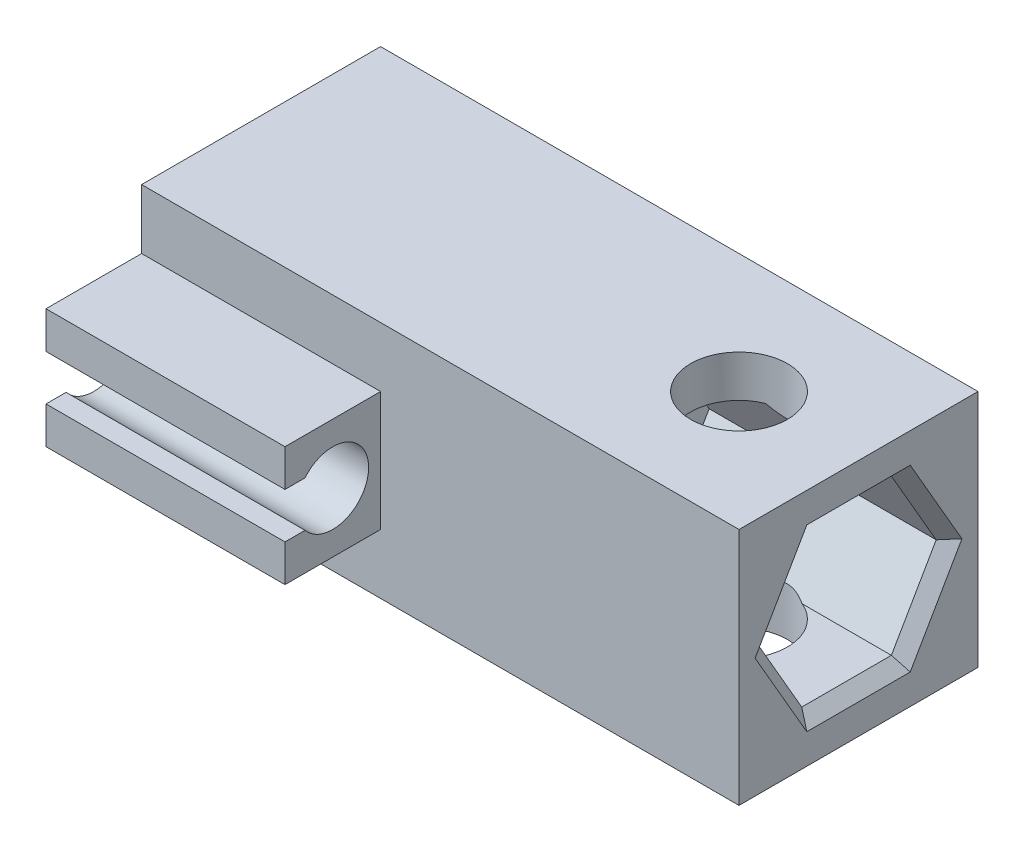
ISO-10303-21;
HEADER;
FILE_DESCRIPTION(('STEP AP214'),'2;1');
FILE_NAME('part.step','',(''),(''),'','','');
FILE_SCHEMA(('AUTOMOTIVE_DESIGN { 1 0 10303 214 1 1 1 1 }'));
ENDSEC;
DATA;
#1=APPLICATION_CONTEXT('core data for automotive mechanical design processes');
#2=APPLICATION_PROTOCOL_DEFINITION('international standard','automotive_design',2000,#1);
#3=PRODUCT_CONTEXT('',#1,'mechanical');
#4=PRODUCT('Part','Part','',(#3));
#5=PRODUCT_RELATED_PRODUCT_CATEGORY('part','',(#4));
#6=PRODUCT_DEFINITION_FORMATION('','',#4);
#7=PRODUCT_DEFINITION_CONTEXT('part definition',#1,'design');
#8=PRODUCT_DEFINITION('design','',#6,#7);
#9=PRODUCT_DEFINITION_SHAPE('','',#8);
#10=(LENGTH_UNIT() NAMED_UNIT(*) SI_UNIT(.MILLI.,.METRE.));
#11=(NAMED_UNIT(*) PLANE_ANGLE_UNIT() SI_UNIT($,.RADIAN.));
#12=(NAMED_UNIT(*) SI_UNIT($,.STERADIAN.) SOLID_ANGLE_UNIT());
#13=UNCERTAINTY_MEASURE_WITH_UNIT(LENGTH_MEASURE(1.E-05),#10,'distance_accuracy_value','');
#14=(GEOMETRIC_REPRESENTATION_CONTEXT(3) GLOBAL_UNCERTAINTY_ASSIGNED_CONTEXT((#13)) GLOBAL_UNIT_ASSIGNED_CONTEXT((#10,
#11,#12)) REPRESENTATION_CONTEXT('',''));
#15=CARTESIAN_POINT('',(0.,0.,0.));
#16=DIRECTION('',(0.,0.,1.));
#17=DIRECTION('',(1.,0.,0.));
#18=AXIS2_PLACEMENT_3D('',#15,#16,#17);
#19=CARTESIAN_POINT('',(25.,20.,10.));
#20=DIRECTION('',(0.,0.,-1.));
#21=DIRECTION('',(-1.,0.,0.));
#22=AXIS2_PLACEMENT_3D('',#19,#20,#21);
#23=PLANE('',#22);
#24=DIRECTION('',(-1.,0.,0.));
#25=VECTOR('',#24,1.);
#26=CARTESIAN_POINT('',(-5.00000000000004,15.,10.));
#27=LINE('',#26,#25);
#28=CARTESIAN_POINT('',(-5.00000000000004,15.,10.));
#29=VERTEX_POINT('',#28);
#30=CARTESIAN_POINT('',(-25.,15.,10.));
#31=VERTEX_POINT('',#30);
#32=EDGE_CURVE('E227',#29,#31,#27,.T.);
#33=ORIENTED_EDGE('',*,*,#32,.F.);
#34=DIRECTION('',(0.,-1.,0.));
#35=VECTOR('',#34,1.);
#36=CARTESIAN_POINT('',(-5.00000000000004,5.,10.));
#37=LINE('',#36,#35);
#38=CARTESIAN_POINT('',(-5.00000000000004,5.,10.));
#39=VERTEX_POINT('',#38);
#40=EDGE_CURVE('E219',#29,#39,#37,.T.);
#41=ORIENTED_EDGE('',*,*,#40,.T.);
#42=DIRECTION('',(-1.,0.,0.));
#43=VECTOR('',#42,1.);
#44=CARTESIAN_POINT('',(-5.00000000000004,5.,10.));
#45=LINE('',#44,#43);
#46=CARTESIAN_POINT('',(-25.,5.,10.));
#47=VERTEX_POINT('',#46);
#48=EDGE_CURVE('E203',#39,#47,#45,.T.);
#49=ORIENTED_EDGE('',*,*,#48,.T.);
#50=DIRECTION('',(0.,-1.,0.));
#51=VECTOR('',#50,1.);
#52=CARTESIAN_POINT('',(-25.,20.,10.));
#53=LINE('',#52,#51);
#54=CARTESIAN_POINT('',(-25.,0.,10.));
#55=VERTEX_POINT('',#54);
#56=EDGE_CURVE('E358',#47,#55,#53,.T.);
#57=ORIENTED_EDGE('',*,*,#56,.T.);
#58=DIRECTION('',(1.,0.,0.));
#59=VECTOR('',#58,1.);
#60=CARTESIAN_POINT('',(25.,0.,10.));
#61=LINE('',#60,#59);
#62=CARTESIAN_POINT('',(25.,0.,10.));
#63=VERTEX_POINT('',#62);
#64=EDGE_CURVE('E345',#55,#63,#61,.T.);
#65=ORIENTED_EDGE('',*,*,#64,.T.);
#66=DIRECTION('',(0.,-1.,0.));
#67=VECTOR('',#66,1.);
#68=CARTESIAN_POINT('',(25.,20.,10.));
#69=LINE('',#68,#67);
#70=CARTESIAN_POINT('',(25.,20.,10.));
#71=VERTEX_POINT('',#70);
#72=EDGE_CURVE('E355',#71,#63,#69,.T.);
#73=ORIENTED_EDGE('',*,*,#72,.F.);
#74=DIRECTION('',(1.,0.,0.));
#75=VECTOR('',#74,1.);
#76=CARTESIAN_POINT('',(25.,20.,10.));
#77=LINE('',#76,#75);
#78=CARTESIAN_POINT('',(-25.,20.,10.));
#79=VERTEX_POINT('',#78);
#80=EDGE_CURVE('E335',#79,#71,#77,.T.);
#81=ORIENTED_EDGE('',*,*,#80,.F.);
#82=EDGE_CURVE('E359',#79,#31,#53,.T.);
#83=ORIENTED_EDGE('',*,*,#82,.T.);
#84=EDGE_LOOP('',(#33,#41,#49,#57,#65,#73,#81,#83));
#85=FACE_BOUND('',#84,.T.);
#86=ADVANCED_FACE('F35',(#85),#23,.F.);
#87=CARTESIAN_POINT('',(25.,10.,0.));
#88=DIRECTION('',(-1.,0.,0.));
#89=DIRECTION('',(0.,0.,1.));
#90=AXIS2_PLACEMENT_3D('',#87,#88,#89);
#91=CYLINDRICAL_SURFACE('',#90,4.1);
#92=CARTESIAN_POINT('',(-25.,10.,0.));
#93=DIRECTION('',(-1.,0.,0.));
#94=DIRECTION('',(0.,0.,1.));
#95=AXIS2_PLACEMENT_3D('',#92,#93,#94);
#96=CIRCLE('',#95,4.1);
#97=CARTESIAN_POINT('',(-25.,10.,4.10000000000001));
#98=VERTEX_POINT('',#97);
#99=EDGE_CURVE('E322',#98,#98,#96,.T.);
#100=ORIENTED_EDGE('',*,*,#99,.T.);
#101=EDGE_LOOP('',(#100));
#102=FACE_BOUND('',#101,.T.);
#103=CARTESIAN_POINT('',(4.99999999999996,10.,0.));
#104=DIRECTION('',(1.,0.,0.));
#105=DIRECTION('',(0.,0.,-1.));
#106=AXIS2_PLACEMENT_3D('',#103,#104,#105);
#107=CIRCLE('',#106,4.1);
#108=CARTESIAN_POINT('',(4.99999999999996,10.,-4.09999999999999));
#109=VERTEX_POINT('',#108);
#110=EDGE_CURVE('E297',#109,#109,#107,.F.);
#111=ORIENTED_EDGE('',*,*,#110,.F.);
#112=EDGE_LOOP('',(#111));
#113=FACE_BOUND('',#112,.T.);
#114=ADVANCED_FACE('F484',(#102,#113),#91,.F.);
#115=CARTESIAN_POINT('',(15.,20.,0.));
#116=DIRECTION('',(0.,-1.,0.));
#117=DIRECTION('',(0.,0.,-1.));
#118=AXIS2_PLACEMENT_3D('',#115,#116,#117);
#119=CYLINDRICAL_SURFACE('',#118,4.05);
#120=CARTESIAN_POINT('',(15.,22.9903810567666,0.));
#121=DIRECTION('',(0.,0.5,-0.866025403784439));
#122=DIRECTION('',(0.,-0.866025403784439,-0.5));
#123=AXIS2_PLACEMENT_3D('',#120,#121,#122);
#124=ELLIPSE('',#123,8.1,4.05);
#125=CARTESIAN_POINT('',(16.5297058540778,16.4951905283833,-3.74999999999999));
#126=VERTEX_POINT('',#125);
#127=CARTESIAN_POINT('',(13.4702941459221,16.4951905283833,-3.74999999999999));
#128=VERTEX_POINT('',#127);
#129=EDGE_CURVE('E316',#126,#128,#124,.T.);
#130=ORIENTED_EDGE('',*,*,#129,.F.);
#131=CARTESIAN_POINT('',(15.,16.4951905283833,0.));
#132=DIRECTION('',(0.,1.,0.));
#133=DIRECTION('',(0.,0.,1.));
#134=AXIS2_PLACEMENT_3D('',#131,#132,#133);
#135=CIRCLE('',#134,4.05);
#136=CARTESIAN_POINT('',(16.5297058540778,16.4951905283833,3.75000000000001));
#137=VERTEX_POINT('',#136);
#138=EDGE_CURVE('E321',#137,#126,#135,.T.);
#139=ORIENTED_EDGE('',*,*,#138,.F.);
#140=CARTESIAN_POINT('',(15.,22.9903810567666,0.));
#141=DIRECTION('',(0.,0.5,0.866025403784439));
#142=DIRECTION('',(0.,-0.866025403784439,0.5));
#143=AXIS2_PLACEMENT_3D('',#140,#141,#142);
#144=ELLIPSE('',#143,8.1,4.05);
#145=CARTESIAN_POINT('',(13.4702941459221,16.4951905283833,3.75000000000001));
#146=VERTEX_POINT('',#145);
#147=EDGE_CURVE('E314',#146,#137,#144,.T.);
#148=ORIENTED_EDGE('',*,*,#147,.F.);
#149=EDGE_CURVE('E318',#128,#146,#135,.T.);
#150=ORIENTED_EDGE('',*,*,#149,.F.);
#151=EDGE_LOOP('',(#130,#139,#148,#150));
#152=FACE_BOUND('',#151,.T.);
#153=CARTESIAN_POINT('',(15.,20.,0.));
#154=DIRECTION('',(0.,1.,0.));
#155=DIRECTION('',(0.,0.,1.));
#156=AXIS2_PLACEMENT_3D('',#153,#154,#155);
#157=CIRCLE('',#156,4.05);
#158=CARTESIAN_POINT('',(15.,20.,4.05));
#159=VERTEX_POINT('',#158);
#160=EDGE_CURVE('E326',#159,#159,#157,.T.);
#161=ORIENTED_EDGE('',*,*,#160,.T.);
#162=EDGE_LOOP('',(#161));
#163=FACE_BOUND('',#162,.T.);
#164=ADVANCED_FACE('F466',(#152,#163),#119,.F.);
#165=CARTESIAN_POINT('',(0.,20.,0.));
#166=DIRECTION('',(0.,1.,0.));
#167=DIRECTION('',(0.,0.,1.));
#168=AXIS2_PLACEMENT_3D('',#165,#166,#167);
#169=PLANE('',#168);
#170=DIRECTION('',(0.,0.,1.));
#171=VECTOR('',#170,1.);
#172=CARTESIAN_POINT('',(-25.,20.,10.));
#173=LINE('',#172,#171);
#174=CARTESIAN_POINT('',(-25.,20.,-9.99999999999999));
#175=VERTEX_POINT('',#174);
#176=EDGE_CURVE('E332',#175,#79,#173,.T.);
#177=ORIENTED_EDGE('',*,*,#176,.T.);
#178=ORIENTED_EDGE('',*,*,#80,.T.);
#179=DIRECTION('',(0.,0.,-1.));
#180=VECTOR('',#179,1.);
#181=CARTESIAN_POINT('',(25.,20.,10.));
#182=LINE('',#181,#180);
#183=CARTESIAN_POINT('',(25.,20.,-10.));
#184=VERTEX_POINT('',#183);
#185=EDGE_CURVE('E338',#71,#184,#182,.T.);
#186=ORIENTED_EDGE('',*,*,#185,.T.);
#187=DIRECTION('',(-1.,0.,0.));
#188=VECTOR('',#187,1.);
#189=CARTESIAN_POINT('',(25.,20.,-10.));
#190=LINE('',#189,#188);
#191=EDGE_CURVE('E340',#184,#175,#190,.T.);
#192=ORIENTED_EDGE('',*,*,#191,.T.);
#193=EDGE_LOOP('',(#177,#178,#186,#192));
#194=FACE_BOUND('',#193,.T.);
#195=ORIENTED_EDGE('',*,*,#160,.F.);
#196=EDGE_LOOP('',(#195));
#197=FACE_BOUND('',#196,.T.);
#198=ADVANCED_FACE('F503',(#194,#197),#169,.T.);
#199=CARTESIAN_POINT('',(0.,0.,0.));
#200=DIRECTION('',(0.,1.,0.));
#201=DIRECTION('',(0.,0.,1.));
#202=AXIS2_PLACEMENT_3D('',#199,#200,#201);
#203=PLANE('',#202);
#204=DIRECTION('',(0.,0.,1.));
#205=VECTOR('',#204,1.);
#206=CARTESIAN_POINT('',(-25.,0.,10.));
#207=LINE('',#206,#205);
#208=CARTESIAN_POINT('',(-25.,0.,-9.99999999999999));
#209=VERTEX_POINT('',#208);
#210=EDGE_CURVE('E329',#209,#55,#207,.T.);
#211=ORIENTED_EDGE('',*,*,#210,.F.);
#212=DIRECTION('',(-1.,0.,0.));
#213=VECTOR('',#212,1.);
#214=CARTESIAN_POINT('',(25.,0.,-10.));
#215=LINE('',#214,#213);
#216=CARTESIAN_POINT('',(25.,0.,-10.));
#217=VERTEX_POINT('',#216);
#218=EDGE_CURVE('E336',#217,#209,#215,.T.);
#219=ORIENTED_EDGE('',*,*,#218,.F.);
#220=DIRECTION('',(0.,0.,-1.));
#221=VECTOR('',#220,1.);
#222=CARTESIAN_POINT('',(25.,0.,10.));
#223=LINE('',#222,#221);
#224=EDGE_CURVE('E347',#63,#217,#223,.T.);
#225=ORIENTED_EDGE('',*,*,#224,.F.);
#226=ORIENTED_EDGE('',*,*,#64,.F.);
#227=EDGE_LOOP('',(#211,#219,#225,#226));
#228=FACE_BOUND('',#227,.T.);
#229=CARTESIAN_POINT('',(15.,0.,0.));
#230=DIRECTION('',(0.,1.,0.));
#231=DIRECTION('',(0.,0.,1.));
#232=AXIS2_PLACEMENT_3D('',#229,#230,#231);
#233=CIRCLE('',#232,4.05);
#234=CARTESIAN_POINT('',(15.,0.,4.05));
#235=VERTEX_POINT('',#234);
#236=EDGE_CURVE('E325',#235,#235,#233,.T.);
#237=ORIENTED_EDGE('',*,*,#236,.T.);
#238=EDGE_LOOP('',(#237));
#239=FACE_BOUND('',#238,.T.);
#240=ADVANCED_FACE('F495',(#228,#239),#203,.F.);
#241=CARTESIAN_POINT('',(-25.,20.,10.));
#242=DIRECTION('',(1.,0.,0.));
#243=DIRECTION('',(0.,0.,-1.));
#244=AXIS2_PLACEMENT_3D('',#241,#242,#243);
#245=PLANE('',#244);
#246=ORIENTED_EDGE('',*,*,#99,.F.);
#247=EDGE_LOOP('',(#246));
#248=FACE_BOUND('',#247,.T.);
#249=ORIENTED_EDGE('',*,*,#210,.T.);
#250=ORIENTED_EDGE('',*,*,#56,.F.);
#251=DIRECTION('',(0.,0.,1.));
#252=VECTOR('',#251,1.);
#253=CARTESIAN_POINT('',(-25.,5.,18.));
#254=LINE('',#253,#252);
#255=CARTESIAN_POINT('',(-25.,5.,18.));
#256=VERTEX_POINT('',#255);
#257=EDGE_CURVE('E208',#47,#256,#254,.T.);
#258=ORIENTED_EDGE('',*,*,#257,.T.);
#259=DIRECTION('',(0.,1.,0.));
#260=VECTOR('',#259,1.);
#261=CARTESIAN_POINT('',(-25.,8.1,18.));
#262=LINE('',#261,#260);
#263=CARTESIAN_POINT('',(-25.,8.1,18.));
#264=VERTEX_POINT('',#263);
#265=EDGE_CURVE('E249',#256,#264,#262,.T.);
#266=ORIENTED_EDGE('',*,*,#265,.T.);
#267=DIRECTION('',(0.,0.,-1.));
#268=VECTOR('',#267,1.);
#269=CARTESIAN_POINT('',(-25.,8.1,16.3216373532488));
#270=LINE('',#269,#268);
#271=CARTESIAN_POINT('',(-25.,8.1,16.3216373532488));
#272=VERTEX_POINT('',#271);
#273=EDGE_CURVE('E252',#264,#272,#270,.T.);
#274=ORIENTED_EDGE('',*,*,#273,.T.);
#275=CARTESIAN_POINT('',(-25.,10.,14.));
#276=DIRECTION('',(1.,0.,0.));
#277=DIRECTION('',(0.,0.,1.));
#278=AXIS2_PLACEMENT_3D('',#275,#276,#277);
#279=CIRCLE('',#278,3.00000000000001);
#280=CARTESIAN_POINT('',(-25.,11.9,16.3216373532488));
#281=VERTEX_POINT('',#280);
#282=EDGE_CURVE('E255',#272,#281,#279,.T.);
#283=ORIENTED_EDGE('',*,*,#282,.T.);
#284=DIRECTION('',(0.,0.,1.));
#285=VECTOR('',#284,1.);
#286=CARTESIAN_POINT('',(-25.,11.9,18.));
#287=LINE('',#286,#285);
#288=CARTESIAN_POINT('',(-25.,11.9,18.));
#289=VERTEX_POINT('',#288);
#290=EDGE_CURVE('E258',#281,#289,#287,.T.);
#291=ORIENTED_EDGE('',*,*,#290,.T.);
#292=DIRECTION('',(0.,1.,0.));
#293=VECTOR('',#292,1.);
#294=CARTESIAN_POINT('',(-25.,15.,18.));
#295=LINE('',#294,#293);
#296=CARTESIAN_POINT('',(-25.,15.,18.));
#297=VERTEX_POINT('',#296);
#298=EDGE_CURVE('E231',#289,#297,#295,.T.);
#299=ORIENTED_EDGE('',*,*,#298,.T.);
#300=DIRECTION('',(0.,0.,-1.));
#301=VECTOR('',#300,1.);
#302=CARTESIAN_POINT('',(-25.,15.,18.));
#303=LINE('',#302,#301);
#304=EDGE_CURVE('E228',#297,#31,#303,.T.);
#305=ORIENTED_EDGE('',*,*,#304,.T.);
#306=ORIENTED_EDGE('',*,*,#82,.F.);
#307=ORIENTED_EDGE('',*,*,#176,.F.);
#308=DIRECTION('',(0.,-1.,0.));
#309=VECTOR('',#308,1.);
#310=CARTESIAN_POINT('',(-25.,20.,-9.99999999999999));
#311=LINE('',#310,#309);
#312=EDGE_CURVE('E342',#175,#209,#311,.T.);
#313=ORIENTED_EDGE('',*,*,#312,.T.);
#314=EDGE_LOOP('',(#249,#250,#258,#266,#274,#283,#291,#299,#305,#306,#307,#313));
#315=FACE_BOUND('',#314,.T.);
#316=ADVANCED_FACE('F493',(#248,#315),#245,.F.);
#317=CARTESIAN_POINT('',(25.,20.,10.));
#318=DIRECTION('',(-1.,0.,0.));
#319=DIRECTION('',(0.,0.,1.));
#320=AXIS2_PLACEMENT_3D('',#317,#318,#319);
#321=PLANE('',#320);
#322=DIRECTION('',(0.,0.,-1.));
#323=VECTOR('',#322,1.);
#324=CARTESIAN_POINT('',(25.,17.4951905283833,10.));
#325=LINE('',#324,#323);
#326=CARTESIAN_POINT('',(25.,17.4951905283833,4.32735026918964));
#327=VERTEX_POINT('',#326);
#328=CARTESIAN_POINT('',(25.,17.4951905283833,-4.32735026918962));
#329=VERTEX_POINT('',#328);
#330=EDGE_CURVE('E373',#327,#329,#325,.T.);
#331=ORIENTED_EDGE('',*,*,#330,.T.);
#332=DIRECTION('',(0.,-0.866025403784439,-0.5));
#333=VECTOR('',#332,1.);
#334=CARTESIAN_POINT('',(25.,25.5777222831138,0.339101615137762));
#335=LINE('',#334,#333);
#336=CARTESIAN_POINT('',(25.,10.,-8.65470053837925));
#337=VERTEX_POINT('',#336);
#338=EDGE_CURVE('E383',#329,#337,#335,.T.);
#339=ORIENTED_EDGE('',*,*,#338,.T.);
#340=DIRECTION('',(0.,-0.866025403784439,0.5));
#341=VECTOR('',#340,1.);
#342=CARTESIAN_POINT('',(25.,9.42227771688617,-8.32115242270663));
#343=LINE('',#342,#341);
#344=CARTESIAN_POINT('',(25.,2.50480947161671,-4.32735026918962));
#345=VERTEX_POINT('',#344);
#346=EDGE_CURVE('E381',#337,#345,#343,.T.);
#347=ORIENTED_EDGE('',*,*,#346,.T.);
#348=DIRECTION('',(0.,0.,1.));
#349=VECTOR('',#348,1.);
#350=CARTESIAN_POINT('',(25.,2.50480947161671,10.));
#351=LINE('',#350,#349);
#352=CARTESIAN_POINT('',(25.,2.50480947161671,4.32735026918963));
#353=VERTEX_POINT('',#352);
#354=EDGE_CURVE('E379',#345,#353,#351,.T.);
#355=ORIENTED_EDGE('',*,*,#354,.T.);
#356=DIRECTION('',(0.,0.866025403784439,0.5));
#357=VECTOR('',#356,1.);
#358=CARTESIAN_POINT('',(25.,18.0825317547305,13.3211524227066));
#359=LINE('',#358,#357);
#360=CARTESIAN_POINT('',(25.,10.,8.65470053837926));
#361=VERTEX_POINT('',#360);
#362=EDGE_CURVE('E377',#353,#361,#359,.T.);
#363=ORIENTED_EDGE('',*,*,#362,.T.);
#364=DIRECTION('',(0.,0.866025403784439,-0.5));
#365=VECTOR('',#364,1.);
#366=CARTESIAN_POINT('',(25.,16.9174682452695,4.66089838486226));
#367=LINE('',#366,#365);
#368=EDGE_CURVE('E375',#361,#327,#367,.T.);
#369=ORIENTED_EDGE('',*,*,#368,.T.);
#370=EDGE_LOOP('',(#331,#339,#347,#355,#363,#369));
#371=FACE_BOUND('',#370,.T.);
#372=ORIENTED_EDGE('',*,*,#224,.T.);
#373=DIRECTION('',(0.,-1.,0.));
#374=VECTOR('',#373,1.);
#375=CARTESIAN_POINT('',(25.,20.,-10.));
#376=LINE('',#375,#374);
#377=EDGE_CURVE('E352',#184,#217,#376,.T.);
#378=ORIENTED_EDGE('',*,*,#377,.F.);
#379=ORIENTED_EDGE('',*,*,#185,.F.);
#380=ORIENTED_EDGE('',*,*,#72,.T.);
#381=EDGE_LOOP('',(#372,#378,#379,#380));
#382=FACE_BOUND('',#381,.T.);
#383=ADVANCED_FACE('F418',(#371,#382),#321,.F.);
#384=CARTESIAN_POINT('',(25.,20.,-10.));
#385=DIRECTION('',(0.,0.,1.));
#386=DIRECTION('',(1.,0.,0.));
#387=AXIS2_PLACEMENT_3D('',#384,#385,#386);
#388=PLANE('',#387);
#389=ORIENTED_EDGE('',*,*,#218,.T.);
#390=ORIENTED_EDGE('',*,*,#312,.F.);
#391=ORIENTED_EDGE('',*,*,#191,.F.);
#392=ORIENTED_EDGE('',*,*,#377,.T.);
#393=EDGE_LOOP('',(#389,#390,#391,#392));
#394=FACE_BOUND('',#393,.T.);
#395=ADVANCED_FACE('F502',(#394),#388,.F.);
#396=CARTESIAN_POINT('',(15.,-2.99038105676657,0.));
#397=DIRECTION('',(0.,-0.5,-0.866025403784439));
#398=DIRECTION('',(0.,-0.866025403784439,0.5));
#399=AXIS2_PLACEMENT_3D('',#396,#397,#398);
#400=ELLIPSE('',#399,8.10000000000001,4.05);
#401=CARTESIAN_POINT('',(13.4702941459221,3.50480947161671,-3.74999999999999));
#402=VERTEX_POINT('',#401);
#403=CARTESIAN_POINT('',(16.5297058540778,3.50480947161671,-3.74999999999999));
#404=VERTEX_POINT('',#403);
#405=EDGE_CURVE('E368',#402,#404,#400,.T.);
#406=ORIENTED_EDGE('',*,*,#405,.F.);
#407=CARTESIAN_POINT('',(15.,3.50480947161671,0.));
#408=DIRECTION('',(0.,-1.,0.));
#409=DIRECTION('',(0.,0.,-1.));
#410=AXIS2_PLACEMENT_3D('',#407,#408,#409);
#411=CIRCLE('',#410,4.05);
#412=CARTESIAN_POINT('',(13.4702941459221,3.50480947161671,3.75));
#413=VERTEX_POINT('',#412);
#414=EDGE_CURVE('E365',#413,#402,#411,.T.);
#415=ORIENTED_EDGE('',*,*,#414,.F.);
#416=CARTESIAN_POINT('',(15.,-2.99038105676658,0.));
#417=DIRECTION('',(0.,-0.5,0.866025403784439));
#418=DIRECTION('',(0.,-0.866025403784439,-0.5));
#419=AXIS2_PLACEMENT_3D('',#416,#417,#418);
#420=ELLIPSE('',#419,8.1,4.05);
#421=CARTESIAN_POINT('',(16.5297058540778,3.50480947161671,3.75));
#422=VERTEX_POINT('',#421);
#423=EDGE_CURVE('E361',#422,#413,#420,.T.);
#424=ORIENTED_EDGE('',*,*,#423,.F.);
#425=EDGE_CURVE('E367',#404,#422,#411,.T.);
#426=ORIENTED_EDGE('',*,*,#425,.F.);
#427=EDGE_LOOP('',(#406,#415,#424,#426));
#428=FACE_BOUND('',#427,.T.);
#429=ORIENTED_EDGE('',*,*,#236,.F.);
#430=EDGE_LOOP('',(#429));
#431=FACE_BOUND('',#430,.T.);
#432=ADVANCED_FACE('F447',(#428,#431),#119,.F.);
#433=CARTESIAN_POINT('',(4.99999999999996,16.4951905283833,-3.74999999999999));
#434=DIRECTION('',(0.,1.,0.));
#435=DIRECTION('',(0.,0.,1.));
#436=AXIS2_PLACEMENT_3D('',#433,#434,#435);
#437=PLANE('',#436);
#438=DIRECTION('',(1.,0.,0.));
#439=VECTOR('',#438,1.);
#440=CARTESIAN_POINT('',(4.99999999999996,16.4951905283833,-3.74999999999999));
#441=LINE('',#440,#439);
#442=CARTESIAN_POINT('',(24.,16.4951905283833,-3.74999999999999));
#443=VERTEX_POINT('',#442);
#444=EDGE_CURVE('E298',#126,#443,#441,.T.);
#445=ORIENTED_EDGE('',*,*,#444,.T.);
#446=DIRECTION('',(0.,0.,1.));
#447=VECTOR('',#446,1.);
#448=CARTESIAN_POINT('',(24.,16.4951905283833,-3.74999999999999));
#449=LINE('',#448,#447);
#450=CARTESIAN_POINT('',(24.,16.4951905283833,3.75000000000001));
#451=VERTEX_POINT('',#450);
#452=EDGE_CURVE('E11',#443,#451,#449,.T.);
#453=ORIENTED_EDGE('',*,*,#452,.T.);
#454=DIRECTION('',(1.,0.,0.));
#455=VECTOR('',#454,1.);
#456=CARTESIAN_POINT('',(4.99999999999996,16.4951905283833,3.75000000000001));
#457=LINE('',#456,#455);
#458=EDGE_CURVE('E293',#137,#451,#457,.T.);
#459=ORIENTED_EDGE('',*,*,#458,.F.);
#460=ORIENTED_EDGE('',*,*,#138,.T.);
#461=EDGE_LOOP('',(#445,#453,#459,#460));
#462=FACE_BOUND('',#461,.T.);
#463=ADVANCED_FACE('F468',(#462),#437,.F.);
#464=CARTESIAN_POINT('',(4.99999999999996,3.50480947161671,3.75));
#465=DIRECTION('',(0.,-1.,0.));
#466=DIRECTION('',(0.,0.,-1.));
#467=AXIS2_PLACEMENT_3D('',#464,#465,#466);
#468=PLANE('',#467);
#469=DIRECTION('',(1.,0.,0.));
#470=VECTOR('',#469,1.);
#471=CARTESIAN_POINT('',(4.99999999999996,3.50480947161671,3.75));
#472=LINE('',#471,#470);
#473=CARTESIAN_POINT('',(24.,3.50480947161671,3.75));
#474=VERTEX_POINT('',#473);
#475=EDGE_CURVE('E309',#422,#474,#472,.T.);
#476=ORIENTED_EDGE('',*,*,#475,.T.);
#477=DIRECTION('',(0.,0.,-1.));
#478=VECTOR('',#477,1.);
#479=CARTESIAN_POINT('',(24.,3.50480947161671,3.75));
#480=LINE('',#479,#478);
#481=CARTESIAN_POINT('',(24.,3.50480947161671,-3.74999999999999));
#482=VERTEX_POINT('',#481);
#483=EDGE_CURVE('E388',#474,#482,#480,.T.);
#484=ORIENTED_EDGE('',*,*,#483,.T.);
#485=DIRECTION('',(1.,0.,0.));
#486=VECTOR('',#485,1.);
#487=CARTESIAN_POINT('',(4.99999999999996,3.50480947161671,-3.74999999999999));
#488=LINE('',#487,#486);
#489=EDGE_CURVE('E305',#404,#482,#488,.T.);
#490=ORIENTED_EDGE('',*,*,#489,.F.);
#491=ORIENTED_EDGE('',*,*,#425,.T.);
#492=EDGE_LOOP('',(#476,#484,#490,#491));
#493=FACE_BOUND('',#492,.T.);
#494=ADVANCED_FACE('F453',(#493),#468,.F.);
#495=CARTESIAN_POINT('',(4.99999999999996,0.,0.));
#496=DIRECTION('',(1.,0.,0.));
#497=DIRECTION('',(0.,0.,-1.));
#498=AXIS2_PLACEMENT_3D('',#495,#496,#497);
#499=PLANE('',#498);
#500=DIRECTION('',(0.,0.,1.));
#501=VECTOR('',#500,1.);
#502=CARTESIAN_POINT('',(4.99999999999996,16.4951905283833,-3.74999999999999));
#503=LINE('',#502,#501);
#504=CARTESIAN_POINT('',(4.99999999999996,16.4951905283833,-3.74999999999999));
#505=VERTEX_POINT('',#504);
#506=CARTESIAN_POINT('',(4.99999999999996,16.4951905283833,3.75000000000001));
#507=VERTEX_POINT('',#506);
#508=EDGE_CURVE('E264',#505,#507,#503,.T.);
#509=ORIENTED_EDGE('',*,*,#508,.T.);
#510=DIRECTION('',(0.,-0.866025403784439,0.5));
#511=VECTOR('',#510,1.);
#512=CARTESIAN_POINT('',(4.99999999999996,16.4951905283833,3.75000000000001));
#513=LINE('',#512,#511);
#514=CARTESIAN_POINT('',(4.99999999999996,10.,7.50000000000001));
#515=VERTEX_POINT('',#514);
#516=EDGE_CURVE('E278',#507,#515,#513,.T.);
#517=ORIENTED_EDGE('',*,*,#516,.T.);
#518=DIRECTION('',(0.,-0.866025403784439,-0.5));
#519=VECTOR('',#518,1.);
#520=CARTESIAN_POINT('',(4.99999999999996,10.,7.50000000000001));
#521=LINE('',#520,#519);
#522=CARTESIAN_POINT('',(4.99999999999996,3.50480947161671,3.75));
#523=VERTEX_POINT('',#522);
#524=EDGE_CURVE('E281',#515,#523,#521,.T.);
#525=ORIENTED_EDGE('',*,*,#524,.T.);
#526=DIRECTION('',(0.,0.,-1.));
#527=VECTOR('',#526,1.);
#528=CARTESIAN_POINT('',(4.99999999999996,3.50480947161671,3.75));
#529=LINE('',#528,#527);
#530=CARTESIAN_POINT('',(4.99999999999996,3.50480947161671,-3.74999999999999));
#531=VERTEX_POINT('',#530);
#532=EDGE_CURVE('E284',#523,#531,#529,.T.);
#533=ORIENTED_EDGE('',*,*,#532,.T.);
#534=DIRECTION('',(0.,0.866025403784439,-0.5));
#535=VECTOR('',#534,1.);
#536=CARTESIAN_POINT('',(4.99999999999996,3.50480947161671,-3.74999999999999));
#537=LINE('',#536,#535);
#538=CARTESIAN_POINT('',(4.99999999999996,10.,-7.49999999999999));
#539=VERTEX_POINT('',#538);
#540=EDGE_CURVE('E287',#531,#539,#537,.T.);
#541=ORIENTED_EDGE('',*,*,#540,.T.);
#542=DIRECTION('',(0.,0.866025403784438,0.5));
#543=VECTOR('',#542,1.);
#544=CARTESIAN_POINT('',(4.99999999999996,10.,-7.49999999999999));
#545=LINE('',#544,#543);
#546=EDGE_CURVE('E290',#539,#505,#545,.T.);
#547=ORIENTED_EDGE('',*,*,#546,.T.);
#548=EDGE_LOOP('',(#509,#517,#525,#533,#541,#547));
#549=FACE_BOUND('',#548,.T.);
#550=ORIENTED_EDGE('',*,*,#110,.T.);
#551=EDGE_LOOP('',(#550));
#552=FACE_BOUND('',#551,.T.);
#553=ADVANCED_FACE('F439',(#549,#552),#499,.T.);
#554=ORIENTED_EDGE('',*,*,#149,.T.);
#555=EDGE_CURVE('E312',#507,#146,#457,.T.);
#556=ORIENTED_EDGE('',*,*,#555,.F.);
#557=ORIENTED_EDGE('',*,*,#508,.F.);
#558=EDGE_CURVE('E294',#505,#128,#441,.T.);
#559=ORIENTED_EDGE('',*,*,#558,.T.);
#560=EDGE_LOOP('',(#554,#556,#557,#559));
#561=FACE_BOUND('',#560,.T.);
#562=ADVANCED_FACE('F462',(#561),#437,.F.);
#563=CARTESIAN_POINT('',(4.99999999999996,10.,-7.49999999999999));
#564=DIRECTION('',(0.,0.5,-0.866025403784439));
#565=DIRECTION('',(0.,0.866025403784439,0.5));
#566=AXIS2_PLACEMENT_3D('',#563,#564,#565);
#567=PLANE('',#566);
#568=DIRECTION('',(1.,0.,0.));
#569=VECTOR('',#568,1.);
#570=CARTESIAN_POINT('',(4.99999999999996,10.,-7.49999999999999));
#571=LINE('',#570,#569);
#572=CARTESIAN_POINT('',(24.,10.,-7.49999999999999));
#573=VERTEX_POINT('',#572);
#574=EDGE_CURVE('E299',#539,#573,#571,.T.);
#575=ORIENTED_EDGE('',*,*,#574,.T.);
#576=DIRECTION('',(0.,0.866025403784439,0.5));
#577=VECTOR('',#576,1.);
#578=CARTESIAN_POINT('',(24.,10.,-7.49999999999999));
#579=LINE('',#578,#577);
#580=EDGE_CURVE('E370',#573,#443,#579,.T.);
#581=ORIENTED_EDGE('',*,*,#580,.T.);
#582=ORIENTED_EDGE('',*,*,#444,.F.);
#583=ORIENTED_EDGE('',*,*,#129,.T.);
#584=ORIENTED_EDGE('',*,*,#558,.F.);
#585=ORIENTED_EDGE('',*,*,#546,.F.);
#586=EDGE_LOOP('',(#575,#581,#582,#583,#584,#585));
#587=FACE_BOUND('',#586,.T.);
#588=ADVANCED_FACE('F435',(#587),#567,.F.);
#589=CARTESIAN_POINT('',(4.99999999999996,3.50480947161671,-3.74999999999999));
#590=DIRECTION('',(0.,-0.5,-0.866025403784439));
#591=DIRECTION('',(0.,0.866025403784439,-0.5));
#592=AXIS2_PLACEMENT_3D('',#589,#590,#591);
#593=PLANE('',#592);
#594=ORIENTED_EDGE('',*,*,#489,.T.);
#595=DIRECTION('',(0.,0.866025403784439,-0.5));
#596=VECTOR('',#595,1.);
#597=CARTESIAN_POINT('',(24.,3.50480947161671,-3.74999999999999));
#598=LINE('',#597,#596);
#599=EDGE_CURVE('E386',#482,#573,#598,.T.);
#600=ORIENTED_EDGE('',*,*,#599,.T.);
#601=ORIENTED_EDGE('',*,*,#574,.F.);
#602=ORIENTED_EDGE('',*,*,#540,.F.);
#603=EDGE_CURVE('E302',#531,#402,#488,.T.);
#604=ORIENTED_EDGE('',*,*,#603,.T.);
#605=ORIENTED_EDGE('',*,*,#405,.T.);
#606=EDGE_LOOP('',(#594,#600,#601,#602,#604,#605));
#607=FACE_BOUND('',#606,.T.);
#608=ADVANCED_FACE('F430',(#607),#593,.F.);
#609=ORIENTED_EDGE('',*,*,#414,.T.);
#610=ORIENTED_EDGE('',*,*,#603,.F.);
#611=ORIENTED_EDGE('',*,*,#532,.F.);
#612=EDGE_CURVE('E306',#523,#413,#472,.T.);
#613=ORIENTED_EDGE('',*,*,#612,.T.);
#614=EDGE_LOOP('',(#609,#610,#611,#613));
#615=FACE_BOUND('',#614,.T.);
#616=ADVANCED_FACE('F558',(#615),#468,.F.);
#617=CARTESIAN_POINT('',(4.99999999999996,10.,7.50000000000001));
#618=DIRECTION('',(0.,-0.5,0.866025403784439));
#619=DIRECTION('',(0.,-0.866025403784439,-0.5));
#620=AXIS2_PLACEMENT_3D('',#617,#618,#619);
#621=PLANE('',#620);
#622=DIRECTION('',(1.,0.,0.));
#623=VECTOR('',#622,1.);
#624=CARTESIAN_POINT('',(4.99999999999996,10.,7.50000000000001));
#625=LINE('',#624,#623);
#626=CARTESIAN_POINT('',(24.,10.,7.50000000000001));
#627=VERTEX_POINT('',#626);
#628=EDGE_CURVE('E310',#515,#627,#625,.T.);
#629=ORIENTED_EDGE('',*,*,#628,.T.);
#630=DIRECTION('',(0.,-0.866025403784439,-0.5));
#631=VECTOR('',#630,1.);
#632=CARTESIAN_POINT('',(24.,10.,7.50000000000001));
#633=LINE('',#632,#631);
#634=EDGE_CURVE('E390',#627,#474,#633,.T.);
#635=ORIENTED_EDGE('',*,*,#634,.T.);
#636=ORIENTED_EDGE('',*,*,#475,.F.);
#637=ORIENTED_EDGE('',*,*,#423,.T.);
#638=ORIENTED_EDGE('',*,*,#612,.F.);
#639=ORIENTED_EDGE('',*,*,#524,.F.);
#640=EDGE_LOOP('',(#629,#635,#636,#637,#638,#639));
#641=FACE_BOUND('',#640,.T.);
#642=ADVANCED_FACE('F455',(#641),#621,.F.);
#643=CARTESIAN_POINT('',(4.99999999999996,16.4951905283833,3.75000000000001));
#644=DIRECTION('',(0.,0.5,0.866025403784439));
#645=DIRECTION('',(0.,-0.866025403784439,0.5));
#646=AXIS2_PLACEMENT_3D('',#643,#644,#645);
#647=PLANE('',#646);
#648=ORIENTED_EDGE('',*,*,#458,.T.);
#649=DIRECTION('',(0.,-0.866025403784439,0.5));
#650=VECTOR('',#649,1.);
#651=CARTESIAN_POINT('',(24.,16.4951905283833,3.75000000000001));
#652=LINE('',#651,#650);
#653=EDGE_CURVE('E44',#451,#627,#652,.T.);
#654=ORIENTED_EDGE('',*,*,#653,.T.);
#655=ORIENTED_EDGE('',*,*,#628,.F.);
#656=ORIENTED_EDGE('',*,*,#516,.F.);
#657=ORIENTED_EDGE('',*,*,#555,.T.);
#658=ORIENTED_EDGE('',*,*,#147,.T.);
#659=EDGE_LOOP('',(#648,#654,#655,#656,#657,#658));
#660=FACE_BOUND('',#659,.T.);
#661=ADVANCED_FACE('F458',(#660),#647,.F.);
#662=CARTESIAN_POINT('',(-5.00000000000003,15.,18.));
#663=DIRECTION('',(0.,1.,0.));
#664=DIRECTION('',(0.,0.,1.));
#665=AXIS2_PLACEMENT_3D('',#662,#663,#664);
#666=PLANE('',#665);
#667=ORIENTED_EDGE('',*,*,#304,.F.);
#668=DIRECTION('',(-1.,0.,0.));
#669=VECTOR('',#668,1.);
#670=CARTESIAN_POINT('',(-5.00000000000003,15.,18.));
#671=LINE('',#670,#669);
#672=CARTESIAN_POINT('',(-5.00000000000003,15.,18.));
#673=VERTEX_POINT('',#672);
#674=EDGE_CURVE('E265',#673,#297,#671,.T.);
#675=ORIENTED_EDGE('',*,*,#674,.F.);
#676=DIRECTION('',(0.,0.,-1.));
#677=VECTOR('',#676,1.);
#678=CARTESIAN_POINT('',(-5.00000000000003,15.,18.));
#679=LINE('',#678,#677);
#680=EDGE_CURVE('E213',#673,#29,#679,.T.);
#681=ORIENTED_EDGE('',*,*,#680,.T.);
#682=ORIENTED_EDGE('',*,*,#32,.T.);
#683=EDGE_LOOP('',(#667,#675,#681,#682));
#684=FACE_BOUND('',#683,.T.);
#685=ADVANCED_FACE('F525',(#684),#666,.T.);
#686=CARTESIAN_POINT('',(-5.00000000000003,15.,18.));
#687=DIRECTION('',(0.,0.,1.));
#688=DIRECTION('',(1.,0.,0.));
#689=AXIS2_PLACEMENT_3D('',#686,#687,#688);
#690=PLANE('',#689);
#691=ORIENTED_EDGE('',*,*,#298,.F.);
#692=DIRECTION('',(-1.,0.,0.));
#693=VECTOR('',#692,1.);
#694=CARTESIAN_POINT('',(-5.00000000000003,11.9,18.));
#695=LINE('',#694,#693);
#696=CARTESIAN_POINT('',(-5.00000000000003,11.9,18.));
#697=VERTEX_POINT('',#696);
#698=EDGE_CURVE('E267',#697,#289,#695,.T.);
#699=ORIENTED_EDGE('',*,*,#698,.F.);
#700=DIRECTION('',(0.,1.,0.));
#701=VECTOR('',#700,1.);
#702=CARTESIAN_POINT('',(-5.00000000000003,15.,18.));
#703=LINE('',#702,#701);
#704=EDGE_CURVE('E244',#697,#673,#703,.T.);
#705=ORIENTED_EDGE('',*,*,#704,.T.);
#706=ORIENTED_EDGE('',*,*,#674,.T.);
#707=EDGE_LOOP('',(#691,#699,#705,#706));
#708=FACE_BOUND('',#707,.T.);
#709=ADVANCED_FACE('F642',(#708),#690,.T.);
#710=CARTESIAN_POINT('',(-5.00000000000003,11.9,18.));
#711=DIRECTION('',(0.,-1.,0.));
#712=DIRECTION('',(0.,0.,-1.));
#713=AXIS2_PLACEMENT_3D('',#710,#711,#712);
#714=PLANE('',#713);
#715=ORIENTED_EDGE('',*,*,#290,.F.);
#716=DIRECTION('',(-1.,0.,0.));
#717=VECTOR('',#716,1.);
#718=CARTESIAN_POINT('',(-5.00000000000003,11.9,16.3216373532488));
#719=LINE('',#718,#717);
#720=CARTESIAN_POINT('',(-5.00000000000003,11.9,16.3216373532488));
#721=VERTEX_POINT('',#720);
#722=EDGE_CURVE('E269',#721,#281,#719,.T.);
#723=ORIENTED_EDGE('',*,*,#722,.F.);
#724=DIRECTION('',(0.,0.,1.));
#725=VECTOR('',#724,1.);
#726=CARTESIAN_POINT('',(-5.00000000000003,11.9,18.));
#727=LINE('',#726,#725);
#728=EDGE_CURVE('E241',#721,#697,#727,.T.);
#729=ORIENTED_EDGE('',*,*,#728,.T.);
#730=ORIENTED_EDGE('',*,*,#698,.T.);
#731=EDGE_LOOP('',(#715,#723,#729,#730));
#732=FACE_BOUND('',#731,.T.);
#733=ADVANCED_FACE('F532',(#732),#714,.T.);
#734=CARTESIAN_POINT('',(-5.00000000000004,10.,14.));
#735=DIRECTION('',(-1.,0.,0.));
#736=DIRECTION('',(0.,0.,1.));
#737=AXIS2_PLACEMENT_3D('',#734,#735,#736);
#738=CYLINDRICAL_SURFACE('',#737,3.00000000000001);
#739=ORIENTED_EDGE('',*,*,#282,.F.);
#740=DIRECTION('',(-1.,0.,0.));
#741=VECTOR('',#740,1.);
#742=CARTESIAN_POINT('',(-5.00000000000004,8.1,16.3216373532488));
#743=LINE('',#742,#741);
#744=CARTESIAN_POINT('',(-5.00000000000004,8.1,16.3216373532488));
#745=VERTEX_POINT('',#744);
#746=EDGE_CURVE('E271',#745,#272,#743,.T.);
#747=ORIENTED_EDGE('',*,*,#746,.F.);
#748=CARTESIAN_POINT('',(-5.00000000000004,10.,14.));
#749=DIRECTION('',(1.,0.,0.));
#750=DIRECTION('',(0.,0.,1.));
#751=AXIS2_PLACEMENT_3D('',#748,#749,#750);
#752=CIRCLE('',#751,3.00000000000001);
#753=EDGE_CURVE('E238',#745,#721,#752,.T.);
#754=ORIENTED_EDGE('',*,*,#753,.T.);
#755=ORIENTED_EDGE('',*,*,#722,.T.);
#756=EDGE_LOOP('',(#739,#747,#754,#755));
#757=FACE_BOUND('',#756,.T.);
#758=ADVANCED_FACE('F535',(#757),#738,.F.);
#759=CARTESIAN_POINT('',(-5.00000000000003,8.1,16.3216373532488));
#760=DIRECTION('',(0.,1.,0.));
#761=DIRECTION('',(0.,0.,1.));
#762=AXIS2_PLACEMENT_3D('',#759,#760,#761);
#763=PLANE('',#762);
#764=ORIENTED_EDGE('',*,*,#273,.F.);
#765=DIRECTION('',(-1.,0.,0.));
#766=VECTOR('',#765,1.);
#767=CARTESIAN_POINT('',(-5.00000000000003,8.1,18.));
#768=LINE('',#767,#766);
#769=CARTESIAN_POINT('',(-5.00000000000003,8.1,18.));
#770=VERTEX_POINT('',#769);
#771=EDGE_CURVE('E273',#770,#264,#768,.T.);
#772=ORIENTED_EDGE('',*,*,#771,.F.);
#773=DIRECTION('',(0.,0.,-1.));
#774=VECTOR('',#773,1.);
#775=CARTESIAN_POINT('',(-5.00000000000003,8.1,16.3216373532488));
#776=LINE('',#775,#774);
#777=EDGE_CURVE('E235',#770,#745,#776,.T.);
#778=ORIENTED_EDGE('',*,*,#777,.T.);
#779=ORIENTED_EDGE('',*,*,#746,.T.);
#780=EDGE_LOOP('',(#764,#772,#778,#779));
#781=FACE_BOUND('',#780,.T.);
#782=ADVANCED_FACE('F538',(#781),#763,.T.);
#783=CARTESIAN_POINT('',(-5.00000000000003,8.1,18.));
#784=DIRECTION('',(0.,0.,1.));
#785=DIRECTION('',(1.,0.,0.));
#786=AXIS2_PLACEMENT_3D('',#783,#784,#785);
#787=PLANE('',#786);
#788=ORIENTED_EDGE('',*,*,#265,.F.);
#789=DIRECTION('',(-1.,0.,0.));
#790=VECTOR('',#789,1.);
#791=CARTESIAN_POINT('',(-5.00000000000003,5.,18.));
#792=LINE('',#791,#790);
#793=CARTESIAN_POINT('',(-5.00000000000003,5.,18.));
#794=VERTEX_POINT('',#793);
#795=EDGE_CURVE('E212',#794,#256,#792,.T.);
#796=ORIENTED_EDGE('',*,*,#795,.F.);
#797=DIRECTION('',(0.,1.,0.));
#798=VECTOR('',#797,1.);
#799=CARTESIAN_POINT('',(-5.00000000000003,8.1,18.));
#800=LINE('',#799,#798);
#801=EDGE_CURVE('E223',#794,#770,#800,.T.);
#802=ORIENTED_EDGE('',*,*,#801,.T.);
#803=ORIENTED_EDGE('',*,*,#771,.T.);
#804=EDGE_LOOP('',(#788,#796,#802,#803));
#805=FACE_BOUND('',#804,.T.);
#806=ADVANCED_FACE('F541',(#805),#787,.T.);
#807=CARTESIAN_POINT('',(-5.00000000000003,5.,18.));
#808=DIRECTION('',(0.,-1.,0.));
#809=DIRECTION('',(0.,0.,-1.));
#810=AXIS2_PLACEMENT_3D('',#807,#808,#809);
#811=PLANE('',#810);
#812=ORIENTED_EDGE('',*,*,#257,.F.);
#813=ORIENTED_EDGE('',*,*,#48,.F.);
#814=DIRECTION('',(0.,0.,1.));
#815=VECTOR('',#814,1.);
#816=CARTESIAN_POINT('',(-5.00000000000003,5.,18.));
#817=LINE('',#816,#815);
#818=EDGE_CURVE('E206',#39,#794,#817,.T.);
#819=ORIENTED_EDGE('',*,*,#818,.T.);
#820=ORIENTED_EDGE('',*,*,#795,.T.);
#821=EDGE_LOOP('',(#812,#813,#819,#820));
#822=FACE_BOUND('',#821,.T.);
#823=ADVANCED_FACE('F205',(#822),#811,.T.);
#824=CARTESIAN_POINT('',(-5.00000000000004,10.,14.));
#825=DIRECTION('',(-1.,0.,0.));
#826=DIRECTION('',(0.,0.,1.));
#827=AXIS2_PLACEMENT_3D('',#824,#825,#826);
#828=PLANE('',#827);
#829=ORIENTED_EDGE('',*,*,#40,.F.);
#830=ORIENTED_EDGE('',*,*,#680,.F.);
#831=ORIENTED_EDGE('',*,*,#704,.F.);
#832=ORIENTED_EDGE('',*,*,#728,.F.);
#833=ORIENTED_EDGE('',*,*,#753,.F.);
#834=ORIENTED_EDGE('',*,*,#777,.F.);
#835=ORIENTED_EDGE('',*,*,#801,.F.);
#836=ORIENTED_EDGE('',*,*,#818,.F.);
#837=EDGE_LOOP('',(#829,#830,#831,#832,#833,#834,#835,#836));
#838=FACE_BOUND('',#837,.T.);
#839=ADVANCED_FACE('F217',(#838),#828,.F.);
#840=CARTESIAN_POINT('',(24.,10.,7.50000000000001));
#841=DIRECTION('',(-0.707106781186547,-0.353553390593274,0.612372435695795));
#842=DIRECTION('',(0.,-0.866025403784439,-0.5));
#843=AXIS2_PLACEMENT_3D('',#840,#841,#842);
#844=PLANE('',#843);
#845=DIRECTION('',(-0.654653670707977,0.,-0.755928946018455));
#846=VECTOR('',#845,1.);
#847=CARTESIAN_POINT('',(24.,10.,7.50000000000001));
#848=LINE('',#847,#846);
#849=EDGE_CURVE('E402',#361,#627,#848,.T.);
#850=ORIENTED_EDGE('',*,*,#849,.F.);
#851=ORIENTED_EDGE('',*,*,#362,.F.);
#852=DIRECTION('',(-0.654653670707977,0.654653670707977,-0.377964473009227));
#853=VECTOR('',#852,1.);
#854=CARTESIAN_POINT('',(24.,3.50480947161671,3.75));
#855=LINE('',#854,#853);
#856=EDGE_CURVE('E39',#474,#353,#855,.F.);
#857=ORIENTED_EDGE('',*,*,#856,.F.);
#858=ORIENTED_EDGE('',*,*,#634,.F.);
#859=EDGE_LOOP('',(#850,#851,#857,#858));
#860=FACE_BOUND('',#859,.T.);
#861=ADVANCED_FACE('F37',(#860),#844,.F.);
#862=CARTESIAN_POINT('',(24.,3.50480947161671,3.75));
#863=DIRECTION('',(-0.707106781186547,-0.707106781186548,0.));
#864=DIRECTION('',(0.,0.,-1.));
#865=AXIS2_PLACEMENT_3D('',#862,#863,#864);
#866=PLANE('',#865);
#867=ORIENTED_EDGE('',*,*,#856,.T.);
#868=ORIENTED_EDGE('',*,*,#354,.F.);
#869=DIRECTION('',(-0.654653670707977,0.654653670707977,0.377964473009228));
#870=VECTOR('',#869,1.);
#871=CARTESIAN_POINT('',(24.,3.50480947161671,-3.74999999999999));
#872=LINE('',#871,#870);
#873=EDGE_CURVE('E400',#482,#345,#872,.F.);
#874=ORIENTED_EDGE('',*,*,#873,.F.);
#875=ORIENTED_EDGE('',*,*,#483,.F.);
#876=EDGE_LOOP('',(#867,#868,#874,#875));
#877=FACE_BOUND('',#876,.T.);
#878=ADVANCED_FACE('F412',(#877),#866,.F.);
#879=CARTESIAN_POINT('',(24.,16.4951905283833,3.75000000000001));
#880=DIRECTION('',(-0.707106781186548,0.353553390593274,0.612372435695794));
#881=DIRECTION('',(0.,-0.866025403784439,0.5));
#882=AXIS2_PLACEMENT_3D('',#879,#880,#881);
#883=PLANE('',#882);
#884=ORIENTED_EDGE('',*,*,#849,.T.);
#885=ORIENTED_EDGE('',*,*,#653,.F.);
#886=DIRECTION('',(-0.654653670707977,-0.654653670707977,-0.377964473009228));
#887=VECTOR('',#886,1.);
#888=CARTESIAN_POINT('',(24.,16.4951905283833,3.75000000000001));
#889=LINE('',#888,#887);
#890=EDGE_CURVE('E397',#327,#451,#889,.T.);
#891=ORIENTED_EDGE('',*,*,#890,.F.);
#892=ORIENTED_EDGE('',*,*,#368,.F.);
#893=EDGE_LOOP('',(#884,#885,#891,#892));
#894=FACE_BOUND('',#893,.T.);
#895=ADVANCED_FACE('F469',(#894),#883,.F.);
#896=CARTESIAN_POINT('',(24.,3.50480947161671,-3.74999999999999));
#897=DIRECTION('',(-0.707106781186548,-0.353553390593273,-0.612372435695794));
#898=DIRECTION('',(0.,0.866025403784439,-0.5));
#899=AXIS2_PLACEMENT_3D('',#896,#897,#898);
#900=PLANE('',#899);
#901=ORIENTED_EDGE('',*,*,#873,.T.);
#902=ORIENTED_EDGE('',*,*,#346,.F.);
#903=DIRECTION('',(-0.654653670707976,0.,0.755928946018455));
#904=VECTOR('',#903,1.);
#905=CARTESIAN_POINT('',(24.,10.,-7.49999999999999));
#906=LINE('',#905,#904);
#907=EDGE_CURVE('E395',#573,#337,#906,.F.);
#908=ORIENTED_EDGE('',*,*,#907,.F.);
#909=ORIENTED_EDGE('',*,*,#599,.F.);
#910=EDGE_LOOP('',(#901,#902,#908,#909));
#911=FACE_BOUND('',#910,.T.);
#912=ADVANCED_FACE('F425',(#911),#900,.F.);
#913=CARTESIAN_POINT('',(24.,16.4951905283833,-3.74999999999999));
#914=DIRECTION('',(-0.707106781186547,0.707106781186547,0.));
#915=DIRECTION('',(0.,0.,1.));
#916=AXIS2_PLACEMENT_3D('',#913,#914,#915);
#917=PLANE('',#916);
#918=ORIENTED_EDGE('',*,*,#890,.T.);
#919=ORIENTED_EDGE('',*,*,#452,.F.);
#920=DIRECTION('',(0.654653670707977,0.654653670707977,-0.377964473009229));
#921=VECTOR('',#920,1.);
#922=CARTESIAN_POINT('',(22.1442312776047,14.6394218059881,-2.67857142857142));
#923=LINE('',#922,#921);
#924=EDGE_CURVE('E393',#329,#443,#923,.F.);
#925=ORIENTED_EDGE('',*,*,#924,.F.);
#926=ORIENTED_EDGE('',*,*,#330,.F.);
#927=EDGE_LOOP('',(#918,#919,#925,#926));
#928=FACE_BOUND('',#927,.T.);
#929=ADVANCED_FACE('F472',(#928),#917,.F.);
#930=CARTESIAN_POINT('',(24.,10.,-7.49999999999999));
#931=DIRECTION('',(-0.707106781186549,0.353553390593273,-0.612372435695793));
#932=DIRECTION('',(0.,0.866025403784439,0.5));
#933=AXIS2_PLACEMENT_3D('',#930,#931,#932);
#934=PLANE('',#933);
#935=ORIENTED_EDGE('',*,*,#907,.T.);
#936=ORIENTED_EDGE('',*,*,#338,.F.);
#937=ORIENTED_EDGE('',*,*,#924,.T.);
#938=ORIENTED_EDGE('',*,*,#580,.F.);
#939=EDGE_LOOP('',(#935,#936,#937,#938));
#940=FACE_BOUND('',#939,.T.);
#941=ADVANCED_FACE('F475',(#940),#934,.F.);
#942=CLOSED_SHELL('',(#86,#114,#164,#198,#240,#316,#383,#395,#432,#463,#494,#553,#562,#588,#608,
#616,#642,#661,#685,#709,#733,#758,#782,#806,#823,#839,#861,#878,#895,#912,#929,#941));
#943=MANIFOLD_SOLID_BREP('B2',#942);
#944=ADVANCED_BREP_SHAPE_REPRESENTATION('',(#18,#943),#14);
#945=SHAPE_DEFINITION_REPRESENTATION(#9,#944);
ENDSEC;
END-ISO-10303-21;
